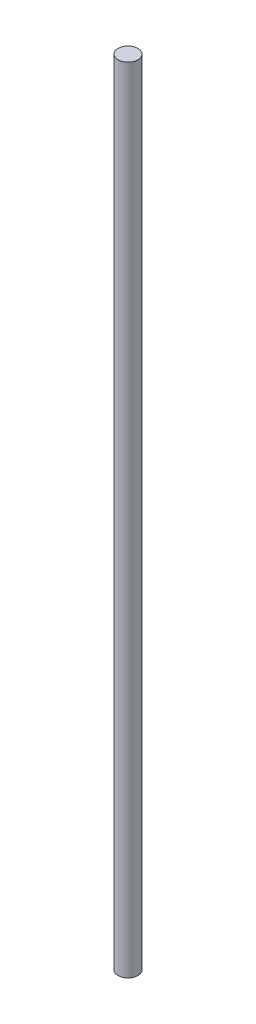
ISO-10303-21;
HEADER;
FILE_DESCRIPTION(('STEP AP214'),'2;1');
FILE_NAME('part.step','',(''),(''),'','','');
FILE_SCHEMA(('AUTOMOTIVE_DESIGN { 1 0 10303 214 1 1 1 1 }'));
ENDSEC;
DATA;
#1=APPLICATION_CONTEXT('core data for automotive mechanical design processes');
#2=APPLICATION_PROTOCOL_DEFINITION('international standard','automotive_design',2000,#1);
#3=PRODUCT_CONTEXT('',#1,'mechanical');
#4=PRODUCT('Part','Part','',(#3));
#5=PRODUCT_RELATED_PRODUCT_CATEGORY('part','',(#4));
#6=PRODUCT_DEFINITION_FORMATION('','',#4);
#7=PRODUCT_DEFINITION_CONTEXT('part definition',#1,'design');
#8=PRODUCT_DEFINITION('design','',#6,#7);
#9=PRODUCT_DEFINITION_SHAPE('','',#8);
#10=(LENGTH_UNIT() NAMED_UNIT(*) SI_UNIT(.MILLI.,.METRE.));
#11=(NAMED_UNIT(*) PLANE_ANGLE_UNIT() SI_UNIT($,.RADIAN.));
#12=(NAMED_UNIT(*) SI_UNIT($,.STERADIAN.) SOLID_ANGLE_UNIT());
#13=UNCERTAINTY_MEASURE_WITH_UNIT(LENGTH_MEASURE(1.E-05),#10,'distance_accuracy_value','');
#14=(GEOMETRIC_REPRESENTATION_CONTEXT(3) GLOBAL_UNCERTAINTY_ASSIGNED_CONTEXT((#13)) GLOBAL_UNIT_ASSIGNED_CONTEXT((#10,
#11,#12)) REPRESENTATION_CONTEXT('',''));
#15=CARTESIAN_POINT('',(0.,0.,0.));
#16=DIRECTION('',(0.,0.,1.));
#17=DIRECTION('',(1.,0.,0.));
#18=AXIS2_PLACEMENT_3D('',#15,#16,#17);
#19=CARTESIAN_POINT('',(0.,127.,0.));
#20=DIRECTION('',(0.,-1.,0.));
#21=DIRECTION('',(0.,0.,-1.));
#22=AXIS2_PLACEMENT_3D('',#19,#20,#21);
#23=CYLINDRICAL_SURFACE('',#22,3.175);
#24=CARTESIAN_POINT('',(0.,127.,0.));
#25=DIRECTION('',(0.,1.,0.));
#26=DIRECTION('',(0.,0.,1.));
#27=AXIS2_PLACEMENT_3D('',#24,#25,#26);
#28=CIRCLE('',#27,3.175);
#29=CARTESIAN_POINT('',(0.,127.,3.175));
#30=VERTEX_POINT('',#29);
#31=EDGE_CURVE('E10',#30,#30,#28,.T.);
#32=ORIENTED_EDGE('',*,*,#31,.F.);
#33=EDGE_LOOP('',(#32));
#34=FACE_BOUND('',#33,.T.);
#35=CARTESIAN_POINT('',(0.,-127.,0.));
#36=DIRECTION('',(0.,1.,0.));
#37=DIRECTION('',(0.,0.,1.));
#38=AXIS2_PLACEMENT_3D('',#35,#36,#37);
#39=CIRCLE('',#38,3.175);
#40=CARTESIAN_POINT('',(0.,-127.,3.175));
#41=VERTEX_POINT('',#40);
#42=EDGE_CURVE('E46',#41,#41,#39,.T.);
#43=ORIENTED_EDGE('',*,*,#42,.T.);
#44=EDGE_LOOP('',(#43));
#45=FACE_BOUND('',#44,.T.);
#46=ADVANCED_FACE('F43',(#34,#45),#23,.T.);
#47=CARTESIAN_POINT('',(0.,127.,0.));
#48=DIRECTION('',(0.,1.,0.));
#49=DIRECTION('',(0.,0.,1.));
#50=AXIS2_PLACEMENT_3D('',#47,#48,#49);
#51=PLANE('',#50);
#52=ORIENTED_EDGE('',*,*,#31,.T.);
#53=EDGE_LOOP('',(#52));
#54=FACE_BOUND('',#53,.T.);
#55=ADVANCED_FACE('F60',(#54),#51,.T.);
#56=CARTESIAN_POINT('',(0.,-127.,0.));
#57=DIRECTION('',(0.,1.,0.));
#58=DIRECTION('',(0.,0.,1.));
#59=AXIS2_PLACEMENT_3D('',#56,#57,#58);
#60=PLANE('',#59);
#61=ORIENTED_EDGE('',*,*,#42,.F.);
#62=EDGE_LOOP('',(#61));
#63=FACE_BOUND('',#62,.T.);
#64=ADVANCED_FACE('F58',(#63),#60,.F.);
#65=CLOSED_SHELL('',(#46,#55,#64));
#66=MANIFOLD_SOLID_BREP('B2',#65);
#67=ADVANCED_BREP_SHAPE_REPRESENTATION('',(#18,#66),#14);
#68=SHAPE_DEFINITION_REPRESENTATION(#9,#67);
ENDSEC;
END-ISO-10303-21;
